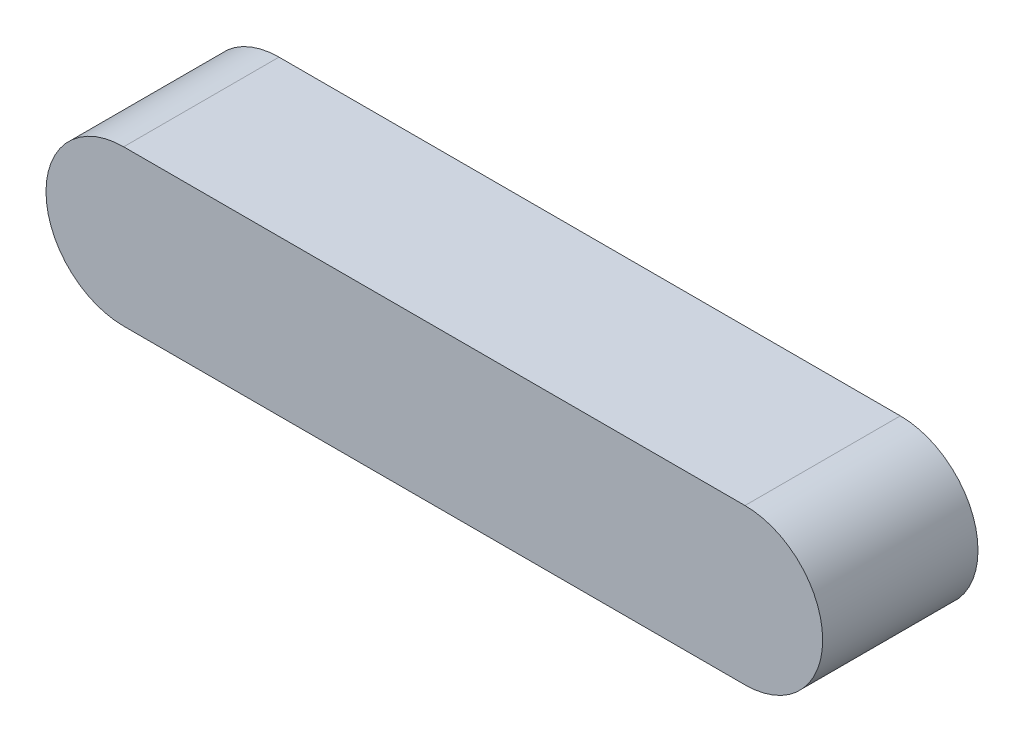
ISO-10303-21;
HEADER;
FILE_DESCRIPTION(('STEP AP214'),'2;1');
FILE_NAME('part.step','',(''),(''),'','','');
FILE_SCHEMA(('AUTOMOTIVE_DESIGN { 1 0 10303 214 1 1 1 1 }'));
ENDSEC;
DATA;
#1=APPLICATION_CONTEXT('core data for automotive mechanical design processes');
#2=APPLICATION_PROTOCOL_DEFINITION('international standard','automotive_design',2000,#1);
#3=PRODUCT_CONTEXT('',#1,'mechanical');
#4=PRODUCT('Part','Part','',(#3));
#5=PRODUCT_RELATED_PRODUCT_CATEGORY('part','',(#4));
#6=PRODUCT_DEFINITION_FORMATION('','',#4);
#7=PRODUCT_DEFINITION_CONTEXT('part definition',#1,'design');
#8=PRODUCT_DEFINITION('design','',#6,#7);
#9=PRODUCT_DEFINITION_SHAPE('','',#8);
#10=(LENGTH_UNIT() NAMED_UNIT(*) SI_UNIT(.MILLI.,.METRE.));
#11=(NAMED_UNIT(*) PLANE_ANGLE_UNIT() SI_UNIT($,.RADIAN.));
#12=(NAMED_UNIT(*) SI_UNIT($,.STERADIAN.) SOLID_ANGLE_UNIT());
#13=UNCERTAINTY_MEASURE_WITH_UNIT(LENGTH_MEASURE(1.E-05),#10,'distance_accuracy_value','');
#14=(GEOMETRIC_REPRESENTATION_CONTEXT(3) GLOBAL_UNCERTAINTY_ASSIGNED_CONTEXT((#13)) GLOBAL_UNIT_ASSIGNED_CONTEXT((#10,
#11,#12)) REPRESENTATION_CONTEXT('',''));
#15=CARTESIAN_POINT('',(0.,0.,0.));
#16=DIRECTION('',(0.,0.,1.));
#17=DIRECTION('',(1.,0.,0.));
#18=AXIS2_PLACEMENT_3D('',#15,#16,#17);
#19=CARTESIAN_POINT('',(-17.5,0.,7.5));
#20=DIRECTION('',(0.,0.,1.));
#21=DIRECTION('',(1.,0.,0.));
#22=AXIS2_PLACEMENT_3D('',#19,#20,#21);
#23=PLANE('',#22);
#24=DIRECTION('',(1.,0.,0.));
#25=VECTOR('',#24,1.);
#26=CARTESIAN_POINT('',(-9.5,2.,7.5));
#27=LINE('',#26,#25);
#28=CARTESIAN_POINT('',(-25.5,2.,7.5));
#29=VERTEX_POINT('',#28);
#30=CARTESIAN_POINT('',(-9.5,2.,7.5));
#31=VERTEX_POINT('',#30);
#32=EDGE_CURVE('E69',#29,#31,#27,.T.);
#33=ORIENTED_EDGE('',*,*,#32,.F.);
#34=CARTESIAN_POINT('',(-25.5,0.,7.5));
#35=DIRECTION('',(0.,0.,-1.));
#36=DIRECTION('',(0.,1.,0.));
#37=AXIS2_PLACEMENT_3D('',#34,#35,#36);
#38=CIRCLE('',#37,2.);
#39=CARTESIAN_POINT('',(-25.5,-2.,7.5));
#40=VERTEX_POINT('',#39);
#41=EDGE_CURVE('E28',#40,#29,#38,.T.);
#42=ORIENTED_EDGE('',*,*,#41,.F.);
#43=DIRECTION('',(-1.,0.,0.));
#44=VECTOR('',#43,1.);
#45=CARTESIAN_POINT('',(-25.5,-2.,7.5));
#46=LINE('',#45,#44);
#47=CARTESIAN_POINT('',(-9.5,-2.,7.5));
#48=VERTEX_POINT('',#47);
#49=EDGE_CURVE('E71',#48,#40,#46,.T.);
#50=ORIENTED_EDGE('',*,*,#49,.F.);
#51=CARTESIAN_POINT('',(-9.5,0.,7.5));
#52=DIRECTION('',(0.,0.,-1.));
#53=DIRECTION('',(0.,-1.,0.));
#54=AXIS2_PLACEMENT_3D('',#51,#52,#53);
#55=CIRCLE('',#54,2.);
#56=EDGE_CURVE('E21',#31,#48,#55,.T.);
#57=ORIENTED_EDGE('',*,*,#56,.F.);
#58=EDGE_LOOP('',(#33,#42,#50,#57));
#59=FACE_BOUND('',#58,.T.);
#60=ADVANCED_FACE('F17',(#59),#23,.T.);
#61=CARTESIAN_POINT('',(-17.5,0.,3.5));
#62=DIRECTION('',(0.,0.,1.));
#63=DIRECTION('',(1.,0.,0.));
#64=AXIS2_PLACEMENT_3D('',#61,#62,#63);
#65=PLANE('',#64);
#66=CARTESIAN_POINT('',(-25.5,0.,3.5));
#67=DIRECTION('',(0.,0.,1.));
#68=DIRECTION('',(0.,1.,0.));
#69=AXIS2_PLACEMENT_3D('',#66,#67,#68);
#70=CIRCLE('',#69,2.);
#71=CARTESIAN_POINT('',(-25.5,2.,3.5));
#72=VERTEX_POINT('',#71);
#73=CARTESIAN_POINT('',(-25.5,-2.,3.5));
#74=VERTEX_POINT('',#73);
#75=EDGE_CURVE('E11',#72,#74,#70,.T.);
#76=ORIENTED_EDGE('',*,*,#75,.F.);
#77=DIRECTION('',(-1.,0.,0.));
#78=VECTOR('',#77,1.);
#79=CARTESIAN_POINT('',(-9.5,2.,3.5));
#80=LINE('',#79,#78);
#81=CARTESIAN_POINT('',(-9.5,2.,3.5));
#82=VERTEX_POINT('',#81);
#83=EDGE_CURVE('E87',#82,#72,#80,.T.);
#84=ORIENTED_EDGE('',*,*,#83,.F.);
#85=CARTESIAN_POINT('',(-9.5,0.,3.5));
#86=DIRECTION('',(0.,0.,1.));
#87=DIRECTION('',(0.,-1.,0.));
#88=AXIS2_PLACEMENT_3D('',#85,#86,#87);
#89=CIRCLE('',#88,2.);
#90=CARTESIAN_POINT('',(-9.5,-2.,3.5));
#91=VERTEX_POINT('',#90);
#92=EDGE_CURVE('E82',#91,#82,#89,.T.);
#93=ORIENTED_EDGE('',*,*,#92,.F.);
#94=DIRECTION('',(1.,0.,0.));
#95=VECTOR('',#94,1.);
#96=CARTESIAN_POINT('',(-25.5,-2.,3.5));
#97=LINE('',#96,#95);
#98=EDGE_CURVE('E100',#74,#91,#97,.T.);
#99=ORIENTED_EDGE('',*,*,#98,.F.);
#100=EDGE_LOOP('',(#76,#84,#93,#99));
#101=FACE_BOUND('',#100,.T.);
#102=ADVANCED_FACE('F118',(#101),#65,.F.);
#103=CARTESIAN_POINT('',(-25.5,0.,3.5));
#104=DIRECTION('',(0.,0.,1.));
#105=DIRECTION('',(0.,1.,0.));
#106=AXIS2_PLACEMENT_3D('',#103,#104,#105);
#107=CYLINDRICAL_SURFACE('',#106,2.);
#108=ORIENTED_EDGE('',*,*,#41,.T.);
#109=DIRECTION('',(0.,0.,1.));
#110=VECTOR('',#109,1.);
#111=CARTESIAN_POINT('',(-25.5,2.,3.5));
#112=LINE('',#111,#110);
#113=EDGE_CURVE('E77',#72,#29,#112,.T.);
#114=ORIENTED_EDGE('',*,*,#113,.F.);
#115=ORIENTED_EDGE('',*,*,#75,.T.);
#116=DIRECTION('',(0.,0.,1.));
#117=VECTOR('',#116,1.);
#118=CARTESIAN_POINT('',(-25.5,-2.,3.5));
#119=LINE('',#118,#117);
#120=EDGE_CURVE('E97',#74,#40,#119,.T.);
#121=ORIENTED_EDGE('',*,*,#120,.T.);
#122=EDGE_LOOP('',(#108,#114,#115,#121));
#123=FACE_BOUND('',#122,.T.);
#124=ADVANCED_FACE('F119',(#123),#107,.T.);
#125=CARTESIAN_POINT('',(-17.5,-2.,3.5));
#126=DIRECTION('',(0.,-1.,0.));
#127=DIRECTION('',(0.,0.,-1.));
#128=AXIS2_PLACEMENT_3D('',#125,#126,#127);
#129=PLANE('',#128);
#130=ORIENTED_EDGE('',*,*,#49,.T.);
#131=ORIENTED_EDGE('',*,*,#120,.F.);
#132=ORIENTED_EDGE('',*,*,#98,.T.);
#133=DIRECTION('',(0.,0.,1.));
#134=VECTOR('',#133,1.);
#135=CARTESIAN_POINT('',(-9.5,-2.,3.5));
#136=LINE('',#135,#134);
#137=EDGE_CURVE('E76',#91,#48,#136,.T.);
#138=ORIENTED_EDGE('',*,*,#137,.T.);
#139=EDGE_LOOP('',(#130,#131,#132,#138));
#140=FACE_BOUND('',#139,.T.);
#141=ADVANCED_FACE('F19',(#140),#129,.T.);
#142=CARTESIAN_POINT('',(-9.5,0.,3.5));
#143=DIRECTION('',(0.,0.,1.));
#144=DIRECTION('',(0.,-1.,0.));
#145=AXIS2_PLACEMENT_3D('',#142,#143,#144);
#146=CYLINDRICAL_SURFACE('',#145,2.);
#147=ORIENTED_EDGE('',*,*,#56,.T.);
#148=ORIENTED_EDGE('',*,*,#137,.F.);
#149=ORIENTED_EDGE('',*,*,#92,.T.);
#150=DIRECTION('',(0.,0.,1.));
#151=VECTOR('',#150,1.);
#152=CARTESIAN_POINT('',(-9.5,2.,3.5));
#153=LINE('',#152,#151);
#154=EDGE_CURVE('E79',#82,#31,#153,.T.);
#155=ORIENTED_EDGE('',*,*,#154,.T.);
#156=EDGE_LOOP('',(#147,#148,#149,#155));
#157=FACE_BOUND('',#156,.T.);
#158=ADVANCED_FACE('F80',(#157),#146,.T.);
#159=CARTESIAN_POINT('',(-17.5,2.,3.5));
#160=DIRECTION('',(0.,1.,0.));
#161=DIRECTION('',(1.,0.,0.));
#162=AXIS2_PLACEMENT_3D('',#159,#160,#161);
#163=PLANE('',#162);
#164=ORIENTED_EDGE('',*,*,#32,.T.);
#165=ORIENTED_EDGE('',*,*,#154,.F.);
#166=ORIENTED_EDGE('',*,*,#83,.T.);
#167=ORIENTED_EDGE('',*,*,#113,.T.);
#168=EDGE_LOOP('',(#164,#165,#166,#167));
#169=FACE_BOUND('',#168,.T.);
#170=ADVANCED_FACE('F89',(#169),#163,.T.);
#171=CLOSED_SHELL('',(#60,#102,#124,#141,#158,#170));
#172=MANIFOLD_SOLID_BREP('B1',#171);
#173=ADVANCED_BREP_SHAPE_REPRESENTATION('',(#18,#172),#14);
#174=SHAPE_DEFINITION_REPRESENTATION(#9,#173);
ENDSEC;
END-ISO-10303-21;
